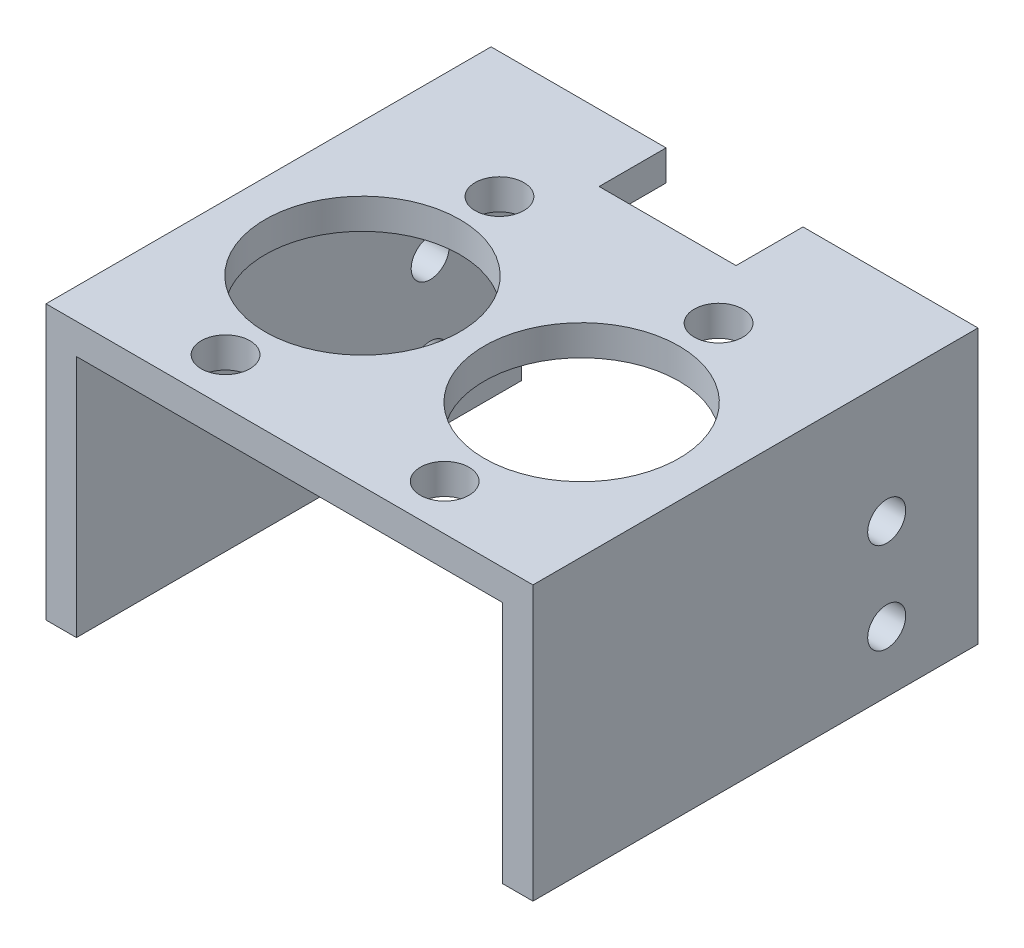
ISO-10303-21;
HEADER;
FILE_DESCRIPTION(('STEP AP214'),'2;1');
FILE_NAME('part.step','',(''),(''),'','','');
FILE_SCHEMA(('AUTOMOTIVE_DESIGN { 1 0 10303 214 1 1 1 1 }'));
ENDSEC;
DATA;
#1=APPLICATION_CONTEXT('core data for automotive mechanical design processes');
#2=APPLICATION_PROTOCOL_DEFINITION('international standard','automotive_design',2000,#1);
#3=PRODUCT_CONTEXT('',#1,'mechanical');
#4=PRODUCT('Part','Part','',(#3));
#5=PRODUCT_RELATED_PRODUCT_CATEGORY('part','',(#4));
#6=PRODUCT_DEFINITION_FORMATION('','',#4);
#7=PRODUCT_DEFINITION_CONTEXT('part definition',#1,'design');
#8=PRODUCT_DEFINITION('design','',#6,#7);
#9=PRODUCT_DEFINITION_SHAPE('','',#8);
#10=(LENGTH_UNIT() NAMED_UNIT(*) SI_UNIT(.MILLI.,.METRE.));
#11=(NAMED_UNIT(*) PLANE_ANGLE_UNIT() SI_UNIT($,.RADIAN.));
#12=(NAMED_UNIT(*) SI_UNIT($,.STERADIAN.) SOLID_ANGLE_UNIT());
#13=UNCERTAINTY_MEASURE_WITH_UNIT(LENGTH_MEASURE(1.E-05),#10,'distance_accuracy_value','');
#14=(GEOMETRIC_REPRESENTATION_CONTEXT(3) GLOBAL_UNCERTAINTY_ASSIGNED_CONTEXT((#13)) GLOBAL_UNIT_ASSIGNED_CONTEXT((#10,
#11,#12)) REPRESENTATION_CONTEXT('',''));
#15=CARTESIAN_POINT('',(0.,0.,0.));
#16=DIRECTION('',(0.,0.,1.));
#17=DIRECTION('',(1.,0.,0.));
#18=AXIS2_PLACEMENT_3D('',#15,#16,#17);
#19=CARTESIAN_POINT('',(0.,50.9034487608193,92.86494));
#20=DIRECTION('',(0.,1.,0.));
#21=DIRECTION('',(0.,0.,1.));
#22=AXIS2_PLACEMENT_3D('',#19,#20,#21);
#23=PLANE('',#22);
#24=CARTESIAN_POINT('',(-84.6786976036436,50.9034487608193,54.76494));
#25=DIRECTION('',(0.,1.,0.));
#26=DIRECTION('',(0.,0.,1.));
#27=AXIS2_PLACEMENT_3D('',#24,#25,#26);
#28=CIRCLE('',#27,20.32);
#29=CARTESIAN_POINT('',(-84.6786976036436,50.9034487608193,75.08494));
#30=VERTEX_POINT('',#29);
#31=EDGE_CURVE('E280',#30,#30,#28,.F.);
#32=ORIENTED_EDGE('',*,*,#31,.F.);
#33=EDGE_LOOP('',(#32));
#34=FACE_BOUND('',#33,.T.);
#35=CARTESIAN_POINT('',(-38.9586976036436,50.9034487608193,54.76494));
#36=DIRECTION('',(0.,1.,0.));
#37=DIRECTION('',(0.,0.,1.));
#38=AXIS2_PLACEMENT_3D('',#35,#36,#37);
#39=CIRCLE('',#38,20.32);
#40=CARTESIAN_POINT('',(-38.9586976036436,50.9034487608193,75.08494));
#41=VERTEX_POINT('',#40);
#42=EDGE_CURVE('E274',#41,#41,#39,.F.);
#43=ORIENTED_EDGE('',*,*,#42,.F.);
#44=EDGE_LOOP('',(#43));
#45=FACE_BOUND('',#44,.T.);
#46=CARTESIAN_POINT('',(-38.9586976036436,50.9034487608193,83.33994));
#47=DIRECTION('',(0.,1.,0.));
#48=DIRECTION('',(0.,0.,1.));
#49=AXIS2_PLACEMENT_3D('',#46,#47,#48);
#50=CIRCLE('',#49,5.08000000000001);
#51=CARTESIAN_POINT('',(-38.9586976036436,50.9034487608193,88.41994));
#52=VERTEX_POINT('',#51);
#53=EDGE_CURVE('E268',#52,#52,#50,.F.);
#54=ORIENTED_EDGE('',*,*,#53,.F.);
#55=EDGE_LOOP('',(#54));
#56=FACE_BOUND('',#55,.T.);
#57=CARTESIAN_POINT('',(-84.6786976036436,50.9034487608193,83.33994));
#58=DIRECTION('',(0.,1.,0.));
#59=DIRECTION('',(0.,0.,1.));
#60=AXIS2_PLACEMENT_3D('',#57,#58,#59);
#61=CIRCLE('',#60,5.08000000000001);
#62=CARTESIAN_POINT('',(-84.6786976036436,50.9034487608193,88.41994));
#63=VERTEX_POINT('',#62);
#64=EDGE_CURVE('E262',#63,#63,#61,.F.);
#65=ORIENTED_EDGE('',*,*,#64,.F.);
#66=EDGE_LOOP('',(#65));
#67=FACE_BOUND('',#66,.T.);
#68=CARTESIAN_POINT('',(-84.6786976036436,50.9034487608193,26.18994));
#69=DIRECTION('',(0.,1.,0.));
#70=DIRECTION('',(0.,0.,1.));
#71=AXIS2_PLACEMENT_3D('',#68,#69,#70);
#72=CIRCLE('',#71,5.08);
#73=CARTESIAN_POINT('',(-84.6786976036436,50.9034487608193,31.26994));
#74=VERTEX_POINT('',#73);
#75=EDGE_CURVE('E256',#74,#74,#72,.F.);
#76=ORIENTED_EDGE('',*,*,#75,.F.);
#77=EDGE_LOOP('',(#76));
#78=FACE_BOUND('',#77,.T.);
#79=CARTESIAN_POINT('',(-38.9586976036436,50.9034487608193,26.18994));
#80=DIRECTION('',(0.,1.,0.));
#81=DIRECTION('',(0.,0.,1.));
#82=AXIS2_PLACEMENT_3D('',#79,#80,#81);
#83=CIRCLE('',#82,5.08000000000001);
#84=CARTESIAN_POINT('',(-38.9586976036436,50.9034487608193,31.26994));
#85=VERTEX_POINT('',#84);
#86=EDGE_CURVE('E250',#85,#85,#83,.F.);
#87=ORIENTED_EDGE('',*,*,#86,.F.);
#88=EDGE_LOOP('',(#87));
#89=FACE_BOUND('',#88,.T.);
#90=DIRECTION('',(0.,0.,1.));
#91=VECTOR('',#90,1.);
#92=CARTESIAN_POINT('',(-76.1061976036436,50.9034487608193,0.));
#93=LINE('',#92,#91);
#94=CARTESIAN_POINT('',(-76.1061976036436,50.9034487608193,0.));
#95=VERTEX_POINT('',#94);
#96=CARTESIAN_POINT('',(-76.1061976036436,50.9034487608193,13.97));
#97=VERTEX_POINT('',#96);
#98=EDGE_CURVE('E243',#95,#97,#93,.T.);
#99=ORIENTED_EDGE('',*,*,#98,.T.);
#100=DIRECTION('',(-1.,0.,0.));
#101=VECTOR('',#100,1.);
#102=CARTESIAN_POINT('',(0.,50.9034487608193,13.97));
#103=LINE('',#102,#101);
#104=CARTESIAN_POINT('',(-47.5311976036436,50.9034487608193,13.97));
#105=VERTEX_POINT('',#104);
#106=EDGE_CURVE('E247',#105,#97,#103,.T.);
#107=ORIENTED_EDGE('',*,*,#106,.F.);
#108=DIRECTION('',(0.,0.,1.));
#109=VECTOR('',#108,1.);
#110=CARTESIAN_POINT('',(-47.5311976036436,50.9034487608193,0.));
#111=LINE('',#110,#109);
#112=CARTESIAN_POINT('',(-47.5311976036436,50.9034487608193,0.));
#113=VERTEX_POINT('',#112);
#114=EDGE_CURVE('E161',#113,#105,#111,.T.);
#115=ORIENTED_EDGE('',*,*,#114,.F.);
#116=DIRECTION('',(1.,0.,0.));
#117=VECTOR('',#116,1.);
#118=CARTESIAN_POINT('',(0.,50.9034487608193,0.));
#119=LINE('',#118,#117);
#120=CARTESIAN_POINT('',(-17.3686976036436,50.9034487608193,0.));
#121=VERTEX_POINT('',#120);
#122=EDGE_CURVE('E163',#113,#121,#119,.T.);
#123=ORIENTED_EDGE('',*,*,#122,.T.);
#124=DIRECTION('',(0.,0.,-1.));
#125=VECTOR('',#124,1.);
#126=CARTESIAN_POINT('',(-17.3686976036436,50.9034487608193,92.86494));
#127=LINE('',#126,#125);
#128=CARTESIAN_POINT('',(-17.3686976036436,50.9034487608193,92.86494));
#129=VERTEX_POINT('',#128);
#130=EDGE_CURVE('E187',#129,#121,#127,.T.);
#131=ORIENTED_EDGE('',*,*,#130,.F.);
#132=DIRECTION('',(1.,0.,0.));
#133=VECTOR('',#132,1.);
#134=CARTESIAN_POINT('',(0.,50.9034487608193,92.86494));
#135=LINE('',#134,#133);
#136=CARTESIAN_POINT('',(-106.268697603644,50.9034487608193,92.86494));
#137=VERTEX_POINT('',#136);
#138=EDGE_CURVE('E196',#137,#129,#135,.T.);
#139=ORIENTED_EDGE('',*,*,#138,.F.);
#140=DIRECTION('',(0.,0.,-1.));
#141=VECTOR('',#140,1.);
#142=CARTESIAN_POINT('',(-106.268697603644,50.9034487608193,92.86494));
#143=LINE('',#142,#141);
#144=CARTESIAN_POINT('',(-106.268697603644,50.9034487608193,0.));
#145=VERTEX_POINT('',#144);
#146=EDGE_CURVE('E55',#137,#145,#143,.T.);
#147=ORIENTED_EDGE('',*,*,#146,.T.);
#148=EDGE_CURVE('E164',#145,#95,#119,.T.);
#149=ORIENTED_EDGE('',*,*,#148,.T.);
#150=EDGE_LOOP('',(#99,#107,#115,#123,#131,#139,#147,#149));
#151=FACE_BOUND('',#150,.T.);
#152=ADVANCED_FACE('F47',(#34,#45,#56,#67,#78,#89,#151),#23,.F.);
#153=CARTESIAN_POINT('',(0.,57.2534487608193,92.86494));
#154=DIRECTION('',(0.,1.,0.));
#155=DIRECTION('',(0.,0.,1.));
#156=AXIS2_PLACEMENT_3D('',#153,#154,#155);
#157=PLANE('',#156);
#158=CARTESIAN_POINT('',(-84.6786976036436,57.2534487608193,54.76494));
#159=DIRECTION('',(0.,1.,0.));
#160=DIRECTION('',(0.,0.,1.));
#161=AXIS2_PLACEMENT_3D('',#158,#159,#160);
#162=CIRCLE('',#161,20.32);
#163=CARTESIAN_POINT('',(-84.6786976036436,57.2534487608193,75.08494));
#164=VERTEX_POINT('',#163);
#165=EDGE_CURVE('E283',#164,#164,#162,.T.);
#166=ORIENTED_EDGE('',*,*,#165,.F.);
#167=EDGE_LOOP('',(#166));
#168=FACE_BOUND('',#167,.T.);
#169=CARTESIAN_POINT('',(-38.9586976036436,57.2534487608193,54.76494));
#170=DIRECTION('',(0.,1.,0.));
#171=DIRECTION('',(0.,0.,1.));
#172=AXIS2_PLACEMENT_3D('',#169,#170,#171);
#173=CIRCLE('',#172,20.32);
#174=CARTESIAN_POINT('',(-38.9586976036436,57.2534487608193,75.08494));
#175=VERTEX_POINT('',#174);
#176=EDGE_CURVE('E277',#175,#175,#173,.T.);
#177=ORIENTED_EDGE('',*,*,#176,.F.);
#178=EDGE_LOOP('',(#177));
#179=FACE_BOUND('',#178,.T.);
#180=CARTESIAN_POINT('',(-38.9586976036436,57.2534487608193,83.33994));
#181=DIRECTION('',(0.,1.,0.));
#182=DIRECTION('',(0.,0.,1.));
#183=AXIS2_PLACEMENT_3D('',#180,#181,#182);
#184=CIRCLE('',#183,5.08000000000001);
#185=CARTESIAN_POINT('',(-38.9586976036436,57.2534487608193,88.41994));
#186=VERTEX_POINT('',#185);
#187=EDGE_CURVE('E271',#186,#186,#184,.T.);
#188=ORIENTED_EDGE('',*,*,#187,.F.);
#189=EDGE_LOOP('',(#188));
#190=FACE_BOUND('',#189,.T.);
#191=CARTESIAN_POINT('',(-84.6786976036436,57.2534487608193,83.33994));
#192=DIRECTION('',(0.,1.,0.));
#193=DIRECTION('',(0.,0.,1.));
#194=AXIS2_PLACEMENT_3D('',#191,#192,#193);
#195=CIRCLE('',#194,5.08000000000001);
#196=CARTESIAN_POINT('',(-84.6786976036436,57.2534487608193,88.41994));
#197=VERTEX_POINT('',#196);
#198=EDGE_CURVE('E265',#197,#197,#195,.T.);
#199=ORIENTED_EDGE('',*,*,#198,.F.);
#200=EDGE_LOOP('',(#199));
#201=FACE_BOUND('',#200,.T.);
#202=CARTESIAN_POINT('',(-84.6786976036436,57.2534487608193,26.18994));
#203=DIRECTION('',(0.,1.,0.));
#204=DIRECTION('',(0.,0.,1.));
#205=AXIS2_PLACEMENT_3D('',#202,#203,#204);
#206=CIRCLE('',#205,5.08);
#207=CARTESIAN_POINT('',(-84.6786976036436,57.2534487608193,31.26994));
#208=VERTEX_POINT('',#207);
#209=EDGE_CURVE('E259',#208,#208,#206,.T.);
#210=ORIENTED_EDGE('',*,*,#209,.F.);
#211=EDGE_LOOP('',(#210));
#212=FACE_BOUND('',#211,.T.);
#213=CARTESIAN_POINT('',(-38.9586976036436,57.2534487608193,26.18994));
#214=DIRECTION('',(0.,1.,0.));
#215=DIRECTION('',(0.,0.,1.));
#216=AXIS2_PLACEMENT_3D('',#213,#214,#215);
#217=CIRCLE('',#216,5.08000000000001);
#218=CARTESIAN_POINT('',(-38.9586976036436,57.2534487608193,31.26994));
#219=VERTEX_POINT('',#218);
#220=EDGE_CURVE('E253',#219,#219,#217,.T.);
#221=ORIENTED_EDGE('',*,*,#220,.F.);
#222=EDGE_LOOP('',(#221));
#223=FACE_BOUND('',#222,.T.);
#224=DIRECTION('',(1.,0.,0.));
#225=VECTOR('',#224,1.);
#226=CARTESIAN_POINT('',(0.,57.2534487608193,13.97));
#227=LINE('',#226,#225);
#228=CARTESIAN_POINT('',(-76.1061976036436,57.2534487608193,13.97));
#229=VERTEX_POINT('',#228);
#230=CARTESIAN_POINT('',(-47.5311976036436,57.2534487608193,13.97));
#231=VERTEX_POINT('',#230);
#232=EDGE_CURVE('E239',#229,#231,#227,.T.);
#233=ORIENTED_EDGE('',*,*,#232,.F.);
#234=DIRECTION('',(0.,0.,-1.));
#235=VECTOR('',#234,1.);
#236=CARTESIAN_POINT('',(-76.1061976036436,57.2534487608193,0.));
#237=LINE('',#236,#235);
#238=CARTESIAN_POINT('',(-76.1061976036436,57.2534487608193,0.));
#239=VERTEX_POINT('',#238);
#240=EDGE_CURVE('E218',#229,#239,#237,.T.);
#241=ORIENTED_EDGE('',*,*,#240,.T.);
#242=DIRECTION('',(1.,0.,0.));
#243=VECTOR('',#242,1.);
#244=CARTESIAN_POINT('',(0.,57.2534487608193,0.));
#245=LINE('',#244,#243);
#246=CARTESIAN_POINT('',(-112.618697603644,57.2534487608193,0.));
#247=VERTEX_POINT('',#246);
#248=EDGE_CURVE('E174',#247,#239,#245,.T.);
#249=ORIENTED_EDGE('',*,*,#248,.F.);
#250=DIRECTION('',(0.,0.,-1.));
#251=VECTOR('',#250,1.);
#252=CARTESIAN_POINT('',(-112.618697603644,57.2534487608193,92.86494));
#253=LINE('',#252,#251);
#254=CARTESIAN_POINT('',(-112.618697603644,57.2534487608193,92.86494));
#255=VERTEX_POINT('',#254);
#256=EDGE_CURVE('E139',#255,#247,#253,.T.);
#257=ORIENTED_EDGE('',*,*,#256,.F.);
#258=DIRECTION('',(1.,0.,0.));
#259=VECTOR('',#258,1.);
#260=CARTESIAN_POINT('',(0.,57.2534487608193,92.86494));
#261=LINE('',#260,#259);
#262=CARTESIAN_POINT('',(-11.0186976036436,57.2534487608193,92.86494));
#263=VERTEX_POINT('',#262);
#264=EDGE_CURVE('E145',#255,#263,#261,.T.);
#265=ORIENTED_EDGE('',*,*,#264,.T.);
#266=DIRECTION('',(0.,0.,-1.));
#267=VECTOR('',#266,1.);
#268=CARTESIAN_POINT('',(-11.0186976036436,57.2534487608193,92.86494));
#269=LINE('',#268,#267);
#270=CARTESIAN_POINT('',(-11.0186976036436,57.2534487608193,0.));
#271=VERTEX_POINT('',#270);
#272=EDGE_CURVE('E129',#263,#271,#269,.T.);
#273=ORIENTED_EDGE('',*,*,#272,.T.);
#274=CARTESIAN_POINT('',(-47.5311976036436,57.2534487608193,0.));
#275=VERTEX_POINT('',#274);
#276=EDGE_CURVE('E173',#275,#271,#245,.T.);
#277=ORIENTED_EDGE('',*,*,#276,.F.);
#278=DIRECTION('',(0.,0.,-1.));
#279=VECTOR('',#278,1.);
#280=CARTESIAN_POINT('',(-47.5311976036436,57.2534487608193,0.));
#281=LINE('',#280,#279);
#282=EDGE_CURVE('E62',#231,#275,#281,.T.);
#283=ORIENTED_EDGE('',*,*,#282,.F.);
#284=EDGE_LOOP('',(#233,#241,#249,#257,#265,#273,#277,#283));
#285=FACE_BOUND('',#284,.T.);
#286=ADVANCED_FACE('F151',(#168,#179,#190,#201,#212,#223,#285),#157,.T.);
#287=CARTESIAN_POINT('',(0.,0.,0.));
#288=DIRECTION('',(0.,0.,1.));
#289=DIRECTION('',(1.,0.,0.));
#290=AXIS2_PLACEMENT_3D('',#287,#288,#289);
#291=PLANE('',#290);
#292=DIRECTION('',(0.,1.,0.));
#293=VECTOR('',#292,1.);
#294=CARTESIAN_POINT('',(-76.1061976036436,0.102448760819301,0.));
#295=LINE('',#294,#293);
#296=EDGE_CURVE('E201',#95,#239,#295,.T.);
#297=ORIENTED_EDGE('',*,*,#296,.F.);
#298=ORIENTED_EDGE('',*,*,#148,.F.);
#299=DIRECTION('',(0.,1.,0.));
#300=VECTOR('',#299,1.);
#301=CARTESIAN_POINT('',(-106.268697603644,0.,0.));
#302=LINE('',#301,#300);
#303=CARTESIAN_POINT('',(-106.268697603644,0.103448760819305,0.));
#304=VERTEX_POINT('',#303);
#305=EDGE_CURVE('E160',#304,#145,#302,.T.);
#306=ORIENTED_EDGE('',*,*,#305,.F.);
#307=DIRECTION('',(1.,0.,0.));
#308=VECTOR('',#307,1.);
#309=CARTESIAN_POINT('',(0.,0.103448760819305,0.));
#310=LINE('',#309,#308);
#311=CARTESIAN_POINT('',(-112.618697603644,0.103448760819305,0.));
#312=VERTEX_POINT('',#311);
#313=EDGE_CURVE('E158',#312,#304,#310,.T.);
#314=ORIENTED_EDGE('',*,*,#313,.F.);
#315=DIRECTION('',(0.,1.,0.));
#316=VECTOR('',#315,1.);
#317=CARTESIAN_POINT('',(-112.618697603644,0.,0.));
#318=LINE('',#317,#316);
#319=EDGE_CURVE('E177',#312,#247,#318,.T.);
#320=ORIENTED_EDGE('',*,*,#319,.T.);
#321=ORIENTED_EDGE('',*,*,#248,.T.);
#322=EDGE_LOOP('',(#297,#298,#306,#314,#320,#321));
#323=FACE_BOUND('',#322,.T.);
#324=ADVANCED_FACE('F199',(#323),#291,.F.);
#325=CARTESIAN_POINT('',(0.,0.103448760819305,92.86494));
#326=DIRECTION('',(0.,1.,0.));
#327=DIRECTION('',(0.,0.,1.));
#328=AXIS2_PLACEMENT_3D('',#325,#326,#327);
#329=PLANE('',#328);
#330=ORIENTED_EDGE('',*,*,#313,.T.);
#331=DIRECTION('',(0.,0.,-1.));
#332=VECTOR('',#331,1.);
#333=CARTESIAN_POINT('',(-106.268697603644,0.103448760819305,92.86494));
#334=LINE('',#333,#332);
#335=CARTESIAN_POINT('',(-106.268697603644,0.103448760819305,92.86494));
#336=VERTEX_POINT('',#335);
#337=EDGE_CURVE('E13',#336,#304,#334,.T.);
#338=ORIENTED_EDGE('',*,*,#337,.F.);
#339=DIRECTION('',(1.,0.,0.));
#340=VECTOR('',#339,1.);
#341=CARTESIAN_POINT('',(0.,0.103448760819305,92.86494));
#342=LINE('',#341,#340);
#343=CARTESIAN_POINT('',(-112.618697603644,0.103448760819305,92.86494));
#344=VERTEX_POINT('',#343);
#345=EDGE_CURVE('E180',#344,#336,#342,.T.);
#346=ORIENTED_EDGE('',*,*,#345,.F.);
#347=DIRECTION('',(0.,0.,-1.));
#348=VECTOR('',#347,1.);
#349=CARTESIAN_POINT('',(-112.618697603644,0.103448760819305,92.86494));
#350=LINE('',#349,#348);
#351=EDGE_CURVE('E71',#344,#312,#350,.T.);
#352=ORIENTED_EDGE('',*,*,#351,.T.);
#353=EDGE_LOOP('',(#330,#338,#346,#352));
#354=FACE_BOUND('',#353,.T.);
#355=ADVANCED_FACE('F49',(#354),#329,.F.);
#356=CARTESIAN_POINT('',(-106.268697603644,0.,92.86494));
#357=DIRECTION('',(-1.,0.,0.));
#358=DIRECTION('',(0.,0.,1.));
#359=AXIS2_PLACEMENT_3D('',#356,#357,#358);
#360=PLANE('',#359);
#361=CARTESIAN_POINT('',(-106.268697603644,31.8534487608193,19.05));
#362=DIRECTION('',(-1.,0.,0.));
#363=DIRECTION('',(0.,0.,1.));
#364=AXIS2_PLACEMENT_3D('',#361,#362,#363);
#365=CIRCLE('',#364,3.96875);
#366=CARTESIAN_POINT('',(-106.268697603644,31.8534487608193,23.01875));
#367=VERTEX_POINT('',#366);
#368=EDGE_CURVE('E296',#367,#367,#365,.T.);
#369=ORIENTED_EDGE('',*,*,#368,.T.);
#370=EDGE_LOOP('',(#369));
#371=FACE_BOUND('',#370,.T.);
#372=CARTESIAN_POINT('',(-106.268697603644,12.8034487608193,19.05));
#373=DIRECTION('',(-1.,0.,0.));
#374=DIRECTION('',(0.,0.,1.));
#375=AXIS2_PLACEMENT_3D('',#372,#373,#374);
#376=CIRCLE('',#375,3.96875);
#377=CARTESIAN_POINT('',(-106.268697603644,12.8034487608193,23.01875));
#378=VERTEX_POINT('',#377);
#379=EDGE_CURVE('E286',#378,#378,#376,.T.);
#380=ORIENTED_EDGE('',*,*,#379,.T.);
#381=EDGE_LOOP('',(#380));
#382=FACE_BOUND('',#381,.T.);
#383=ORIENTED_EDGE('',*,*,#305,.T.);
#384=ORIENTED_EDGE('',*,*,#146,.F.);
#385=DIRECTION('',(0.,1.,0.));
#386=VECTOR('',#385,1.);
#387=CARTESIAN_POINT('',(-106.268697603644,0.,92.86494));
#388=LINE('',#387,#386);
#389=EDGE_CURVE('E110',#336,#137,#388,.T.);
#390=ORIENTED_EDGE('',*,*,#389,.F.);
#391=ORIENTED_EDGE('',*,*,#337,.T.);
#392=EDGE_LOOP('',(#383,#384,#390,#391));
#393=FACE_BOUND('',#392,.T.);
#394=ADVANCED_FACE('F322',(#371,#382,#393),#360,.F.);
#395=CARTESIAN_POINT('',(-17.3686976036436,0.,92.86494));
#396=DIRECTION('',(1.,0.,0.));
#397=DIRECTION('',(0.,0.,-1.));
#398=AXIS2_PLACEMENT_3D('',#395,#396,#397);
#399=PLANE('',#398);
#400=CARTESIAN_POINT('',(-17.3686976036436,31.8534487608193,19.05));
#401=DIRECTION('',(1.,0.,0.));
#402=DIRECTION('',(0.,0.,-1.));
#403=AXIS2_PLACEMENT_3D('',#400,#401,#402);
#404=CIRCLE('',#403,3.96875);
#405=CARTESIAN_POINT('',(-17.3686976036436,31.8534487608193,15.08125));
#406=VERTEX_POINT('',#405);
#407=EDGE_CURVE('E301',#406,#406,#404,.T.);
#408=ORIENTED_EDGE('',*,*,#407,.T.);
#409=EDGE_LOOP('',(#408));
#410=FACE_BOUND('',#409,.T.);
#411=CARTESIAN_POINT('',(-17.3686976036436,12.8034487608193,19.05));
#412=DIRECTION('',(1.,0.,0.));
#413=DIRECTION('',(0.,0.,-1.));
#414=AXIS2_PLACEMENT_3D('',#411,#412,#413);
#415=CIRCLE('',#414,3.96875);
#416=CARTESIAN_POINT('',(-17.3686976036436,12.8034487608193,15.08125));
#417=VERTEX_POINT('',#416);
#418=EDGE_CURVE('E289',#417,#417,#415,.T.);
#419=ORIENTED_EDGE('',*,*,#418,.T.);
#420=EDGE_LOOP('',(#419));
#421=FACE_BOUND('',#420,.T.);
#422=DIRECTION('',(0.,-1.,0.));
#423=VECTOR('',#422,1.);
#424=CARTESIAN_POINT('',(-17.3686976036436,0.,0.));
#425=LINE('',#424,#423);
#426=CARTESIAN_POINT('',(-17.3686976036436,0.103448760819305,0.));
#427=VERTEX_POINT('',#426);
#428=EDGE_CURVE('E167',#121,#427,#425,.T.);
#429=ORIENTED_EDGE('',*,*,#428,.T.);
#430=DIRECTION('',(0.,0.,-1.));
#431=VECTOR('',#430,1.);
#432=CARTESIAN_POINT('',(-17.3686976036436,0.103448760819305,92.86494));
#433=LINE('',#432,#431);
#434=CARTESIAN_POINT('',(-17.3686976036436,0.103448760819305,92.86494));
#435=VERTEX_POINT('',#434);
#436=EDGE_CURVE('E184',#435,#427,#433,.T.);
#437=ORIENTED_EDGE('',*,*,#436,.F.);
#438=DIRECTION('',(0.,-1.,0.));
#439=VECTOR('',#438,1.);
#440=CARTESIAN_POINT('',(-17.3686976036436,0.,92.86494));
#441=LINE('',#440,#439);
#442=EDGE_CURVE('E224',#129,#435,#441,.T.);
#443=ORIENTED_EDGE('',*,*,#442,.F.);
#444=ORIENTED_EDGE('',*,*,#130,.T.);
#445=EDGE_LOOP('',(#429,#437,#443,#444));
#446=FACE_BOUND('',#445,.T.);
#447=ADVANCED_FACE('F228',(#410,#421,#446),#399,.F.);
#448=CARTESIAN_POINT('',(0.,0.103448760819305,92.86494));
#449=DIRECTION('',(0.,1.,0.));
#450=DIRECTION('',(-1.,0.,0.));
#451=AXIS2_PLACEMENT_3D('',#448,#449,#450);
#452=PLANE('',#451);
#453=DIRECTION('',(1.,0.,0.));
#454=VECTOR('',#453,1.);
#455=CARTESIAN_POINT('',(0.,0.103448760819305,0.));
#456=LINE('',#455,#454);
#457=CARTESIAN_POINT('',(-11.0186976036436,0.103448760819305,0.));
#458=VERTEX_POINT('',#457);
#459=EDGE_CURVE('E169',#427,#458,#456,.T.);
#460=ORIENTED_EDGE('',*,*,#459,.T.);
#461=DIRECTION('',(0.,0.,-1.));
#462=VECTOR('',#461,1.);
#463=CARTESIAN_POINT('',(-11.0186976036436,0.103448760819305,92.86494));
#464=LINE('',#463,#462);
#465=CARTESIAN_POINT('',(-11.0186976036436,0.103448760819305,92.86494));
#466=VERTEX_POINT('',#465);
#467=EDGE_CURVE('E138',#466,#458,#464,.T.);
#468=ORIENTED_EDGE('',*,*,#467,.F.);
#469=DIRECTION('',(1.,0.,0.));
#470=VECTOR('',#469,1.);
#471=CARTESIAN_POINT('',(0.,0.103448760819305,92.86494));
#472=LINE('',#471,#470);
#473=EDGE_CURVE('E147',#435,#466,#472,.T.);
#474=ORIENTED_EDGE('',*,*,#473,.F.);
#475=ORIENTED_EDGE('',*,*,#436,.T.);
#476=EDGE_LOOP('',(#460,#468,#474,#475));
#477=FACE_BOUND('',#476,.T.);
#478=ADVANCED_FACE('F232',(#477),#452,.F.);
#479=CARTESIAN_POINT('',(-11.0186976036436,0.,92.86494));
#480=DIRECTION('',(1.,0.,0.));
#481=DIRECTION('',(0.,1.,0.));
#482=AXIS2_PLACEMENT_3D('',#479,#480,#481);
#483=PLANE('',#482);
#484=CARTESIAN_POINT('',(-11.0186976036436,31.8534487608193,19.05));
#485=DIRECTION('',(-1.,0.,0.));
#486=DIRECTION('',(0.,0.,1.));
#487=AXIS2_PLACEMENT_3D('',#484,#485,#486);
#488=CIRCLE('',#487,3.96875);
#489=CARTESIAN_POINT('',(-11.0186976036436,31.8534487608193,23.01875));
#490=VERTEX_POINT('',#489);
#491=EDGE_CURVE('E304',#490,#490,#488,.T.);
#492=ORIENTED_EDGE('',*,*,#491,.T.);
#493=EDGE_LOOP('',(#492));
#494=FACE_BOUND('',#493,.T.);
#495=CARTESIAN_POINT('',(-11.0186976036436,12.8034487608193,19.05));
#496=DIRECTION('',(-1.,0.,0.));
#497=DIRECTION('',(0.,0.,1.));
#498=AXIS2_PLACEMENT_3D('',#495,#496,#497);
#499=CIRCLE('',#498,3.96875);
#500=CARTESIAN_POINT('',(-11.0186976036436,12.8034487608193,23.01875));
#501=VERTEX_POINT('',#500);
#502=EDGE_CURVE('E292',#501,#501,#499,.T.);
#503=ORIENTED_EDGE('',*,*,#502,.T.);
#504=EDGE_LOOP('',(#503));
#505=FACE_BOUND('',#504,.T.);
#506=DIRECTION('',(0.,-1.,0.));
#507=VECTOR('',#506,1.);
#508=CARTESIAN_POINT('',(-11.0186976036436,0.,0.));
#509=LINE('',#508,#507);
#510=EDGE_CURVE('E134',#271,#458,#509,.T.);
#511=ORIENTED_EDGE('',*,*,#510,.F.);
#512=ORIENTED_EDGE('',*,*,#272,.F.);
#513=DIRECTION('',(0.,-1.,0.));
#514=VECTOR('',#513,1.);
#515=CARTESIAN_POINT('',(-11.0186976036436,0.,92.86494));
#516=LINE('',#515,#514);
#517=EDGE_CURVE('E132',#263,#466,#516,.T.);
#518=ORIENTED_EDGE('',*,*,#517,.T.);
#519=ORIENTED_EDGE('',*,*,#467,.T.);
#520=EDGE_LOOP('',(#511,#512,#518,#519));
#521=FACE_BOUND('',#520,.T.);
#522=ADVANCED_FACE('F131',(#494,#505,#521),#483,.T.);
#523=CARTESIAN_POINT('',(-112.618697603644,0.,92.86494));
#524=DIRECTION('',(-1.,0.,0.));
#525=DIRECTION('',(0.,0.,1.));
#526=AXIS2_PLACEMENT_3D('',#523,#524,#525);
#527=PLANE('',#526);
#528=CARTESIAN_POINT('',(-112.618697603644,31.8534487608193,19.05));
#529=DIRECTION('',(-1.,0.,0.));
#530=DIRECTION('',(0.,0.,1.));
#531=AXIS2_PLACEMENT_3D('',#528,#529,#530);
#532=CIRCLE('',#531,3.96875);
#533=CARTESIAN_POINT('',(-112.618697603644,31.8534487608193,23.01875));
#534=VERTEX_POINT('',#533);
#535=EDGE_CURVE('E305',#534,#534,#532,.T.);
#536=ORIENTED_EDGE('',*,*,#535,.F.);
#537=EDGE_LOOP('',(#536));
#538=FACE_BOUND('',#537,.T.);
#539=CARTESIAN_POINT('',(-112.618697603644,12.8034487608193,19.05));
#540=DIRECTION('',(-1.,0.,0.));
#541=DIRECTION('',(0.,0.,1.));
#542=AXIS2_PLACEMENT_3D('',#539,#540,#541);
#543=CIRCLE('',#542,3.96875);
#544=CARTESIAN_POINT('',(-112.618697603644,12.8034487608193,23.01875));
#545=VERTEX_POINT('',#544);
#546=EDGE_CURVE('E293',#545,#545,#543,.T.);
#547=ORIENTED_EDGE('',*,*,#546,.F.);
#548=EDGE_LOOP('',(#547));
#549=FACE_BOUND('',#548,.T.);
#550=ORIENTED_EDGE('',*,*,#319,.F.);
#551=ORIENTED_EDGE('',*,*,#351,.F.);
#552=DIRECTION('',(0.,1.,0.));
#553=VECTOR('',#552,1.);
#554=CARTESIAN_POINT('',(-112.618697603644,0.,92.86494));
#555=LINE('',#554,#553);
#556=EDGE_CURVE('E153',#344,#255,#555,.T.);
#557=ORIENTED_EDGE('',*,*,#556,.T.);
#558=ORIENTED_EDGE('',*,*,#256,.T.);
#559=EDGE_LOOP('',(#550,#551,#557,#558));
#560=FACE_BOUND('',#559,.T.);
#561=ADVANCED_FACE('F360',(#538,#549,#560),#527,.T.);
#562=CARTESIAN_POINT('',(0.,0.,92.86494));
#563=DIRECTION('',(0.,0.,1.));
#564=DIRECTION('',(1.,0.,0.));
#565=AXIS2_PLACEMENT_3D('',#562,#563,#564);
#566=PLANE('',#565);
#567=ORIENTED_EDGE('',*,*,#345,.T.);
#568=ORIENTED_EDGE('',*,*,#389,.T.);
#569=ORIENTED_EDGE('',*,*,#138,.T.);
#570=ORIENTED_EDGE('',*,*,#442,.T.);
#571=ORIENTED_EDGE('',*,*,#473,.T.);
#572=ORIENTED_EDGE('',*,*,#517,.F.);
#573=ORIENTED_EDGE('',*,*,#264,.F.);
#574=ORIENTED_EDGE('',*,*,#556,.F.);
#575=EDGE_LOOP('',(#567,#568,#569,#570,#571,#572,#573,#574));
#576=FACE_BOUND('',#575,.T.);
#577=ADVANCED_FACE('F143',(#576),#566,.T.);
#578=ORIENTED_EDGE('',*,*,#122,.F.);
#579=DIRECTION('',(0.,1.,0.));
#580=VECTOR('',#579,1.);
#581=CARTESIAN_POINT('',(-47.5311976036436,0.102448760819301,0.));
#582=LINE('',#581,#580);
#583=EDGE_CURVE('E209',#113,#275,#582,.T.);
#584=ORIENTED_EDGE('',*,*,#583,.T.);
#585=ORIENTED_EDGE('',*,*,#276,.T.);
#586=ORIENTED_EDGE('',*,*,#510,.T.);
#587=ORIENTED_EDGE('',*,*,#459,.F.);
#588=ORIENTED_EDGE('',*,*,#428,.F.);
#589=EDGE_LOOP('',(#578,#584,#585,#586,#587,#588));
#590=FACE_BOUND('',#589,.T.);
#591=ADVANCED_FACE('F235',(#590),#291,.F.);
#592=CARTESIAN_POINT('',(0.,0.102448760819301,13.97));
#593=DIRECTION('',(0.,0.,1.));
#594=DIRECTION('',(1.,0.,0.));
#595=AXIS2_PLACEMENT_3D('',#592,#593,#594);
#596=PLANE('',#595);
#597=ORIENTED_EDGE('',*,*,#106,.T.);
#598=DIRECTION('',(0.,1.,0.));
#599=VECTOR('',#598,1.);
#600=CARTESIAN_POINT('',(-76.1061976036436,0.102448760819301,13.97));
#601=LINE('',#600,#599);
#602=EDGE_CURVE('E208',#97,#229,#601,.T.);
#603=ORIENTED_EDGE('',*,*,#602,.T.);
#604=ORIENTED_EDGE('',*,*,#232,.T.);
#605=DIRECTION('',(0.,1.,0.));
#606=VECTOR('',#605,1.);
#607=CARTESIAN_POINT('',(-47.5311976036436,0.102448760819301,13.97));
#608=LINE('',#607,#606);
#609=EDGE_CURVE('E213',#105,#231,#608,.T.);
#610=ORIENTED_EDGE('',*,*,#609,.F.);
#611=EDGE_LOOP('',(#597,#603,#604,#610));
#612=FACE_BOUND('',#611,.T.);
#613=ADVANCED_FACE('F369',(#612),#596,.F.);
#614=CARTESIAN_POINT('',(-76.1061976036436,0.102448760819301,0.));
#615=DIRECTION('',(1.,0.,0.));
#616=DIRECTION('',(0.,0.,-1.));
#617=AXIS2_PLACEMENT_3D('',#614,#615,#616);
#618=PLANE('',#617);
#619=ORIENTED_EDGE('',*,*,#296,.T.);
#620=ORIENTED_EDGE('',*,*,#240,.F.);
#621=ORIENTED_EDGE('',*,*,#602,.F.);
#622=ORIENTED_EDGE('',*,*,#98,.F.);
#623=EDGE_LOOP('',(#619,#620,#621,#622));
#624=FACE_BOUND('',#623,.T.);
#625=ADVANCED_FACE('F363',(#624),#618,.T.);
#626=CARTESIAN_POINT('',(-47.5311976036436,0.102448760819301,0.));
#627=DIRECTION('',(1.,0.,0.));
#628=DIRECTION('',(0.,0.,-1.));
#629=AXIS2_PLACEMENT_3D('',#626,#627,#628);
#630=PLANE('',#629);
#631=ORIENTED_EDGE('',*,*,#114,.T.);
#632=ORIENTED_EDGE('',*,*,#609,.T.);
#633=ORIENTED_EDGE('',*,*,#282,.T.);
#634=ORIENTED_EDGE('',*,*,#583,.F.);
#635=EDGE_LOOP('',(#631,#632,#633,#634));
#636=FACE_BOUND('',#635,.T.);
#637=ADVANCED_FACE('F372',(#636),#630,.F.);
#638=CARTESIAN_POINT('',(-38.9586976036436,0.102448760819301,26.18994));
#639=DIRECTION('',(0.,1.,0.));
#640=DIRECTION('',(0.,0.,1.));
#641=AXIS2_PLACEMENT_3D('',#638,#639,#640);
#642=CYLINDRICAL_SURFACE('',#641,5.08000000000001);
#643=ORIENTED_EDGE('',*,*,#220,.T.);
#644=EDGE_LOOP('',(#643));
#645=FACE_BOUND('',#644,.T.);
#646=ORIENTED_EDGE('',*,*,#86,.T.);
#647=EDGE_LOOP('',(#646));
#648=FACE_BOUND('',#647,.T.);
#649=ADVANCED_FACE('F374',(#645,#648),#642,.F.);
#650=CARTESIAN_POINT('',(-84.6786976036436,0.102448760819301,26.18994));
#651=DIRECTION('',(0.,1.,0.));
#652=DIRECTION('',(0.,0.,1.));
#653=AXIS2_PLACEMENT_3D('',#650,#651,#652);
#654=CYLINDRICAL_SURFACE('',#653,5.08);
#655=ORIENTED_EDGE('',*,*,#209,.T.);
#656=EDGE_LOOP('',(#655));
#657=FACE_BOUND('',#656,.T.);
#658=ORIENTED_EDGE('',*,*,#75,.T.);
#659=EDGE_LOOP('',(#658));
#660=FACE_BOUND('',#659,.T.);
#661=ADVANCED_FACE('F380',(#657,#660),#654,.F.);
#662=CARTESIAN_POINT('',(-84.6786976036436,0.102448760819301,83.33994));
#663=DIRECTION('',(0.,1.,0.));
#664=DIRECTION('',(0.,0.,1.));
#665=AXIS2_PLACEMENT_3D('',#662,#663,#664);
#666=CYLINDRICAL_SURFACE('',#665,5.08000000000001);
#667=ORIENTED_EDGE('',*,*,#198,.T.);
#668=EDGE_LOOP('',(#667));
#669=FACE_BOUND('',#668,.T.);
#670=ORIENTED_EDGE('',*,*,#64,.T.);
#671=EDGE_LOOP('',(#670));
#672=FACE_BOUND('',#671,.T.);
#673=ADVANCED_FACE('F446',(#669,#672),#666,.F.);
#674=CARTESIAN_POINT('',(-38.9586976036436,0.102448760819301,83.33994));
#675=DIRECTION('',(0.,1.,0.));
#676=DIRECTION('',(0.,0.,1.));
#677=AXIS2_PLACEMENT_3D('',#674,#675,#676);
#678=CYLINDRICAL_SURFACE('',#677,5.08000000000001);
#679=ORIENTED_EDGE('',*,*,#187,.T.);
#680=EDGE_LOOP('',(#679));
#681=FACE_BOUND('',#680,.T.);
#682=ORIENTED_EDGE('',*,*,#53,.T.);
#683=EDGE_LOOP('',(#682));
#684=FACE_BOUND('',#683,.T.);
#685=ADVANCED_FACE('F456',(#681,#684),#678,.F.);
#686=CARTESIAN_POINT('',(-38.9586976036436,0.102448760819301,54.76494));
#687=DIRECTION('',(0.,1.,0.));
#688=DIRECTION('',(0.,0.,1.));
#689=AXIS2_PLACEMENT_3D('',#686,#687,#688);
#690=CYLINDRICAL_SURFACE('',#689,20.32);
#691=ORIENTED_EDGE('',*,*,#176,.T.);
#692=EDGE_LOOP('',(#691));
#693=FACE_BOUND('',#692,.T.);
#694=ORIENTED_EDGE('',*,*,#42,.T.);
#695=EDGE_LOOP('',(#694));
#696=FACE_BOUND('',#695,.T.);
#697=ADVANCED_FACE('F466',(#693,#696),#690,.F.);
#698=CARTESIAN_POINT('',(-84.6786976036436,0.102448760819301,54.76494));
#699=DIRECTION('',(0.,1.,0.));
#700=DIRECTION('',(0.,0.,1.));
#701=AXIS2_PLACEMENT_3D('',#698,#699,#700);
#702=CYLINDRICAL_SURFACE('',#701,20.32);
#703=ORIENTED_EDGE('',*,*,#165,.T.);
#704=EDGE_LOOP('',(#703));
#705=FACE_BOUND('',#704,.T.);
#706=ORIENTED_EDGE('',*,*,#31,.T.);
#707=EDGE_LOOP('',(#706));
#708=FACE_BOUND('',#707,.T.);
#709=ADVANCED_FACE('F336',(#705,#708),#702,.F.);
#710=CARTESIAN_POINT('',(-11.0186976036436,12.8034487608193,19.05));
#711=DIRECTION('',(-1.,0.,0.));
#712=DIRECTION('',(0.,0.,1.));
#713=AXIS2_PLACEMENT_3D('',#710,#711,#712);
#714=CYLINDRICAL_SURFACE('',#713,3.96875);
#715=ORIENTED_EDGE('',*,*,#546,.T.);
#716=EDGE_LOOP('',(#715));
#717=FACE_BOUND('',#716,.T.);
#718=ORIENTED_EDGE('',*,*,#379,.F.);
#719=EDGE_LOOP('',(#718));
#720=FACE_BOUND('',#719,.T.);
#721=ADVANCED_FACE('F328',(#717,#720),#714,.F.);
#722=ORIENTED_EDGE('',*,*,#502,.F.);
#723=EDGE_LOOP('',(#722));
#724=FACE_BOUND('',#723,.T.);
#725=ORIENTED_EDGE('',*,*,#418,.F.);
#726=EDGE_LOOP('',(#725));
#727=FACE_BOUND('',#726,.T.);
#728=ADVANCED_FACE('F326',(#724,#727),#714,.F.);
#729=CARTESIAN_POINT('',(-11.0186976036436,31.8534487608193,19.05));
#730=DIRECTION('',(-1.,0.,0.));
#731=DIRECTION('',(0.,0.,1.));
#732=AXIS2_PLACEMENT_3D('',#729,#730,#731);
#733=CYLINDRICAL_SURFACE('',#732,3.96875);
#734=ORIENTED_EDGE('',*,*,#535,.T.);
#735=EDGE_LOOP('',(#734));
#736=FACE_BOUND('',#735,.T.);
#737=ORIENTED_EDGE('',*,*,#368,.F.);
#738=EDGE_LOOP('',(#737));
#739=FACE_BOUND('',#738,.T.);
#740=ADVANCED_FACE('F316',(#736,#739),#733,.F.);
#741=ORIENTED_EDGE('',*,*,#491,.F.);
#742=EDGE_LOOP('',(#741));
#743=FACE_BOUND('',#742,.T.);
#744=ORIENTED_EDGE('',*,*,#407,.F.);
#745=EDGE_LOOP('',(#744));
#746=FACE_BOUND('',#745,.T.);
#747=ADVANCED_FACE('F313',(#743,#746),#733,.F.);
#748=CLOSED_SHELL('',(#152,#286,#324,#355,#394,#447,#478,#522,#561,#577,#591,#613,#625,#637,
#649,#661,#673,#685,#697,#709,#721,#728,#740,#747));
#749=MANIFOLD_SOLID_BREP('B2',#748);
#750=ADVANCED_BREP_SHAPE_REPRESENTATION('',(#18,#749),#14);
#751=SHAPE_DEFINITION_REPRESENTATION(#9,#750);
ENDSEC;
END-ISO-10303-21;
